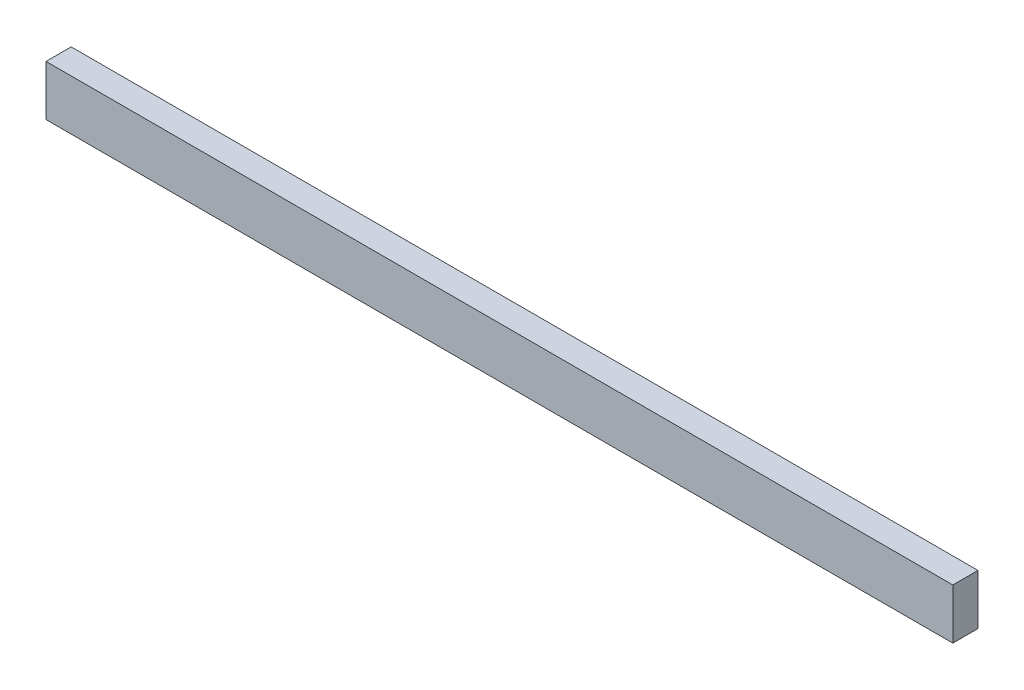
ISO-10303-21;
HEADER;
FILE_DESCRIPTION(('STEP AP214'),'2;1');
FILE_NAME('part.step','',(''),(''),'','','');
FILE_SCHEMA(('AUTOMOTIVE_DESIGN { 1 0 10303 214 1 1 1 1 }'));
ENDSEC;
DATA;
#1=APPLICATION_CONTEXT('core data for automotive mechanical design processes');
#2=APPLICATION_PROTOCOL_DEFINITION('international standard','automotive_design',2000,#1);
#3=PRODUCT_CONTEXT('',#1,'mechanical');
#4=PRODUCT('Part','Part','',(#3));
#5=PRODUCT_RELATED_PRODUCT_CATEGORY('part','',(#4));
#6=PRODUCT_DEFINITION_FORMATION('','',#4);
#7=PRODUCT_DEFINITION_CONTEXT('part definition',#1,'design');
#8=PRODUCT_DEFINITION('design','',#6,#7);
#9=PRODUCT_DEFINITION_SHAPE('','',#8);
#10=(LENGTH_UNIT() NAMED_UNIT(*) SI_UNIT(.MILLI.,.METRE.));
#11=(NAMED_UNIT(*) PLANE_ANGLE_UNIT() SI_UNIT($,.RADIAN.));
#12=(NAMED_UNIT(*) SI_UNIT($,.STERADIAN.) SOLID_ANGLE_UNIT());
#13=UNCERTAINTY_MEASURE_WITH_UNIT(LENGTH_MEASURE(1.E-05),#10,'distance_accuracy_value','');
#14=(GEOMETRIC_REPRESENTATION_CONTEXT(3) GLOBAL_UNCERTAINTY_ASSIGNED_CONTEXT((#13)) GLOBAL_UNIT_ASSIGNED_CONTEXT((#10,
#11,#12)) REPRESENTATION_CONTEXT('',''));
#15=CARTESIAN_POINT('',(0.,0.,0.));
#16=DIRECTION('',(0.,0.,1.));
#17=DIRECTION('',(1.,0.,0.));
#18=AXIS2_PLACEMENT_3D('',#15,#16,#17);
#19=CARTESIAN_POINT('',(150.301810865191,50.4778672032193,10.));
#20=DIRECTION('',(-1.,0.,0.));
#21=DIRECTION('',(0.,0.,1.));
#22=AXIS2_PLACEMENT_3D('',#19,#20,#21);
#23=PLANE('',#22);
#24=DIRECTION('',(0.,1.,0.));
#25=VECTOR('',#24,1.);
#26=CARTESIAN_POINT('',(150.301810865191,50.4778672032193,0.));
#27=LINE('',#26,#25);
#28=CARTESIAN_POINT('',(150.301810865191,30.4778672032193,0.));
#29=VERTEX_POINT('',#28);
#30=CARTESIAN_POINT('',(150.301810865191,50.4778672032193,0.));
#31=VERTEX_POINT('',#30);
#32=EDGE_CURVE('E95',#29,#31,#27,.T.);
#33=ORIENTED_EDGE('',*,*,#32,.T.);
#34=DIRECTION('',(0.,0.,-1.));
#35=VECTOR('',#34,1.);
#36=CARTESIAN_POINT('',(150.301810865191,50.4778672032193,10.));
#37=LINE('',#36,#35);
#38=CARTESIAN_POINT('',(150.301810865191,50.4778672032193,10.));
#39=VERTEX_POINT('',#38);
#40=EDGE_CURVE('E11',#39,#31,#37,.T.);
#41=ORIENTED_EDGE('',*,*,#40,.F.);
#42=DIRECTION('',(0.,1.,0.));
#43=VECTOR('',#42,1.);
#44=CARTESIAN_POINT('',(150.301810865191,50.4778672032193,10.));
#45=LINE('',#44,#43);
#46=CARTESIAN_POINT('',(150.301810865191,30.4778672032193,10.));
#47=VERTEX_POINT('',#46);
#48=EDGE_CURVE('E83',#47,#39,#45,.T.);
#49=ORIENTED_EDGE('',*,*,#48,.F.);
#50=DIRECTION('',(0.,0.,-1.));
#51=VECTOR('',#50,1.);
#52=CARTESIAN_POINT('',(150.301810865191,30.4778672032193,10.));
#53=LINE('',#52,#51);
#54=EDGE_CURVE('E91',#47,#29,#53,.T.);
#55=ORIENTED_EDGE('',*,*,#54,.T.);
#56=EDGE_LOOP('',(#33,#41,#49,#55));
#57=FACE_BOUND('',#56,.T.);
#58=ADVANCED_FACE('F32',(#57),#23,.F.);
#59=CARTESIAN_POINT('',(-209.698189134809,50.4778672032193,10.));
#60=DIRECTION('',(0.,-1.,0.));
#61=DIRECTION('',(0.,0.,-1.));
#62=AXIS2_PLACEMENT_3D('',#59,#60,#61);
#63=PLANE('',#62);
#64=DIRECTION('',(-1.,0.,0.));
#65=VECTOR('',#64,1.);
#66=CARTESIAN_POINT('',(-209.698189134809,50.4778672032193,0.));
#67=LINE('',#66,#65);
#68=CARTESIAN_POINT('',(-209.698189134809,50.4778672032193,0.));
#69=VERTEX_POINT('',#68);
#70=EDGE_CURVE('E87',#31,#69,#67,.T.);
#71=ORIENTED_EDGE('',*,*,#70,.T.);
#72=DIRECTION('',(0.,0.,-1.));
#73=VECTOR('',#72,1.);
#74=CARTESIAN_POINT('',(-209.698189134809,50.4778672032193,10.));
#75=LINE('',#74,#73);
#76=CARTESIAN_POINT('',(-209.698189134809,50.4778672032193,10.));
#77=VERTEX_POINT('',#76);
#78=EDGE_CURVE('E40',#77,#69,#75,.T.);
#79=ORIENTED_EDGE('',*,*,#78,.F.);
#80=DIRECTION('',(-1.,0.,0.));
#81=VECTOR('',#80,1.);
#82=CARTESIAN_POINT('',(-209.698189134809,50.4778672032193,10.));
#83=LINE('',#82,#81);
#84=EDGE_CURVE('E78',#39,#77,#83,.T.);
#85=ORIENTED_EDGE('',*,*,#84,.F.);
#86=ORIENTED_EDGE('',*,*,#40,.T.);
#87=EDGE_LOOP('',(#71,#79,#85,#86));
#88=FACE_BOUND('',#87,.T.);
#89=ADVANCED_FACE('F86',(#88),#63,.F.);
#90=CARTESIAN_POINT('',(-209.698189134809,50.4778672032193,10.));
#91=DIRECTION('',(1.,0.,0.));
#92=DIRECTION('',(0.,0.,-1.));
#93=AXIS2_PLACEMENT_3D('',#90,#91,#92);
#94=PLANE('',#93);
#95=DIRECTION('',(0.,-1.,0.));
#96=VECTOR('',#95,1.);
#97=CARTESIAN_POINT('',(-209.698189134809,50.4778672032193,0.));
#98=LINE('',#97,#96);
#99=CARTESIAN_POINT('',(-209.698189134809,30.4778672032193,0.));
#100=VERTEX_POINT('',#99);
#101=EDGE_CURVE('E65',#69,#100,#98,.T.);
#102=ORIENTED_EDGE('',*,*,#101,.T.);
#103=DIRECTION('',(0.,0.,-1.));
#104=VECTOR('',#103,1.);
#105=CARTESIAN_POINT('',(-209.698189134809,30.4778672032193,10.));
#106=LINE('',#105,#104);
#107=CARTESIAN_POINT('',(-209.698189134809,30.4778672032193,10.));
#108=VERTEX_POINT('',#107);
#109=EDGE_CURVE('E88',#108,#100,#106,.T.);
#110=ORIENTED_EDGE('',*,*,#109,.F.);
#111=DIRECTION('',(0.,-1.,0.));
#112=VECTOR('',#111,1.);
#113=CARTESIAN_POINT('',(-209.698189134809,50.4778672032193,10.));
#114=LINE('',#113,#112);
#115=EDGE_CURVE('E81',#77,#108,#114,.T.);
#116=ORIENTED_EDGE('',*,*,#115,.F.);
#117=ORIENTED_EDGE('',*,*,#78,.T.);
#118=EDGE_LOOP('',(#102,#110,#116,#117));
#119=FACE_BOUND('',#118,.T.);
#120=ADVANCED_FACE('F89',(#119),#94,.F.);
#121=CARTESIAN_POINT('',(-209.698189134809,30.4778672032193,10.));
#122=DIRECTION('',(0.,1.,0.));
#123=DIRECTION('',(0.,0.,1.));
#124=AXIS2_PLACEMENT_3D('',#121,#122,#123);
#125=PLANE('',#124);
#126=DIRECTION('',(1.,0.,0.));
#127=VECTOR('',#126,1.);
#128=CARTESIAN_POINT('',(-209.698189134809,30.4778672032193,0.));
#129=LINE('',#128,#127);
#130=EDGE_CURVE('E71',#100,#29,#129,.T.);
#131=ORIENTED_EDGE('',*,*,#130,.T.);
#132=ORIENTED_EDGE('',*,*,#54,.F.);
#133=DIRECTION('',(1.,0.,0.));
#134=VECTOR('',#133,1.);
#135=CARTESIAN_POINT('',(-209.698189134809,30.4778672032193,10.));
#136=LINE('',#135,#134);
#137=EDGE_CURVE('E48',#108,#47,#136,.T.);
#138=ORIENTED_EDGE('',*,*,#137,.F.);
#139=ORIENTED_EDGE('',*,*,#109,.T.);
#140=EDGE_LOOP('',(#131,#132,#138,#139));
#141=FACE_BOUND('',#140,.T.);
#142=ADVANCED_FACE('F102',(#141),#125,.F.);
#143=CARTESIAN_POINT('',(0.,0.,10.));
#144=DIRECTION('',(0.,0.,1.));
#145=DIRECTION('',(1.,0.,0.));
#146=AXIS2_PLACEMENT_3D('',#143,#144,#145);
#147=PLANE('',#146);
#148=ORIENTED_EDGE('',*,*,#48,.T.);
#149=ORIENTED_EDGE('',*,*,#84,.T.);
#150=ORIENTED_EDGE('',*,*,#115,.T.);
#151=ORIENTED_EDGE('',*,*,#137,.T.);
#152=EDGE_LOOP('',(#148,#149,#150,#151));
#153=FACE_BOUND('',#152,.T.);
#154=ADVANCED_FACE('F79',(#153),#147,.T.);
#155=CARTESIAN_POINT('',(0.,0.,0.));
#156=DIRECTION('',(0.,0.,1.));
#157=DIRECTION('',(1.,0.,0.));
#158=AXIS2_PLACEMENT_3D('',#155,#156,#157);
#159=PLANE('',#158);
#160=ORIENTED_EDGE('',*,*,#32,.F.);
#161=ORIENTED_EDGE('',*,*,#130,.F.);
#162=ORIENTED_EDGE('',*,*,#101,.F.);
#163=ORIENTED_EDGE('',*,*,#70,.F.);
#164=EDGE_LOOP('',(#160,#161,#162,#163));
#165=FACE_BOUND('',#164,.T.);
#166=ADVANCED_FACE('F105',(#165),#159,.F.);
#167=CLOSED_SHELL('',(#58,#89,#120,#142,#154,#166));
#168=MANIFOLD_SOLID_BREP('B2',#167);
#169=ADVANCED_BREP_SHAPE_REPRESENTATION('',(#18,#168),#14);
#170=SHAPE_DEFINITION_REPRESENTATION(#9,#169);
ENDSEC;
END-ISO-10303-21;
